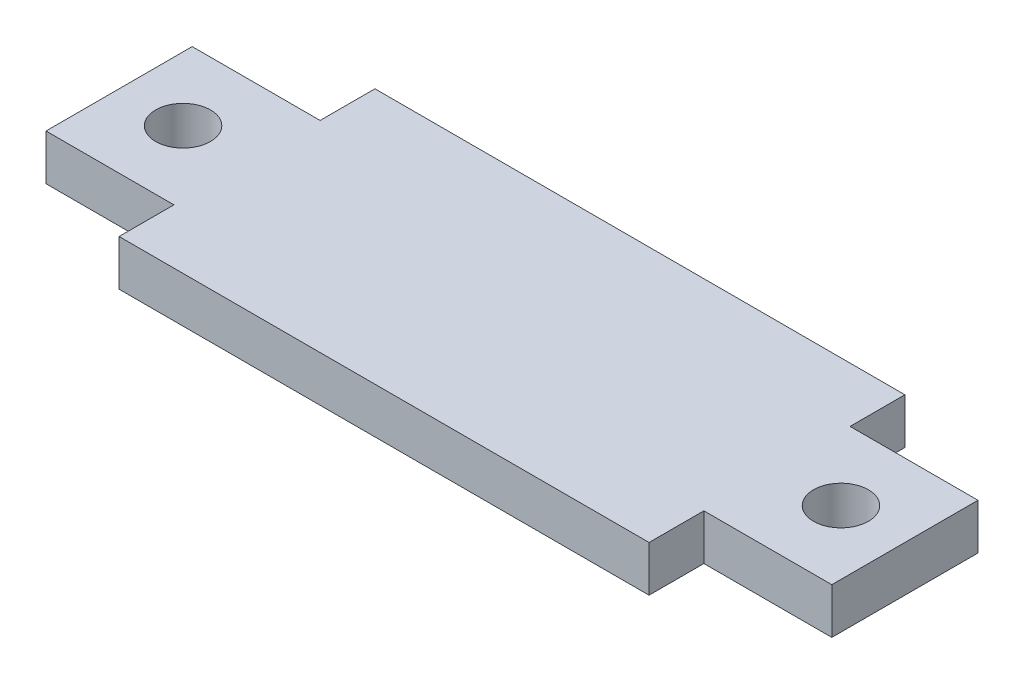
ISO-10303-21;
HEADER;
FILE_DESCRIPTION(('STEP AP214'),'2;1');
FILE_NAME('part.step','',(''),(''),'','','');
FILE_SCHEMA(('AUTOMOTIVE_DESIGN { 1 0 10303 214 1 1 1 1 }'));
ENDSEC;
DATA;
#1=APPLICATION_CONTEXT('core data for automotive mechanical design processes');
#2=APPLICATION_PROTOCOL_DEFINITION('international standard','automotive_design',2000,#1);
#3=PRODUCT_CONTEXT('',#1,'mechanical');
#4=PRODUCT('Part','Part','',(#3));
#5=PRODUCT_RELATED_PRODUCT_CATEGORY('part','',(#4));
#6=PRODUCT_DEFINITION_FORMATION('','',#4);
#7=PRODUCT_DEFINITION_CONTEXT('part definition',#1,'design');
#8=PRODUCT_DEFINITION('design','',#6,#7);
#9=PRODUCT_DEFINITION_SHAPE('','',#8);
#10=(LENGTH_UNIT() NAMED_UNIT(*) SI_UNIT(.MILLI.,.METRE.));
#11=(NAMED_UNIT(*) PLANE_ANGLE_UNIT() SI_UNIT($,.RADIAN.));
#12=(NAMED_UNIT(*) SI_UNIT($,.STERADIAN.) SOLID_ANGLE_UNIT());
#13=UNCERTAINTY_MEASURE_WITH_UNIT(LENGTH_MEASURE(1.E-05),#10,'distance_accuracy_value','');
#14=(GEOMETRIC_REPRESENTATION_CONTEXT(3) GLOBAL_UNCERTAINTY_ASSIGNED_CONTEXT((#13)) GLOBAL_UNIT_ASSIGNED_CONTEXT((#10,
#11,#12)) REPRESENTATION_CONTEXT('',''));
#15=CARTESIAN_POINT('',(0.,0.,0.));
#16=DIRECTION('',(0.,0.,1.));
#17=DIRECTION('',(1.,0.,0.));
#18=AXIS2_PLACEMENT_3D('',#15,#16,#17);
#19=CARTESIAN_POINT('',(14.5,2.5,0.));
#20=DIRECTION('',(1.,0.,0.));
#21=DIRECTION('',(0.,0.,-1.));
#22=AXIS2_PLACEMENT_3D('',#19,#20,#21);
#23=PLANE('',#22);
#24=DIRECTION('',(0.,0.,1.));
#25=VECTOR('',#24,1.);
#26=CARTESIAN_POINT('',(14.5,0.,0.));
#27=LINE('',#26,#25);
#28=CARTESIAN_POINT('',(14.5,0.,-7.));
#29=VERTEX_POINT('',#28);
#30=CARTESIAN_POINT('',(14.5,0.,-4.));
#31=VERTEX_POINT('',#30);
#32=EDGE_CURVE('E159',#29,#31,#27,.T.);
#33=ORIENTED_EDGE('',*,*,#32,.F.);
#34=DIRECTION('',(0.,-1.,0.));
#35=VECTOR('',#34,1.);
#36=CARTESIAN_POINT('',(14.5,2.5,-7.));
#37=LINE('',#36,#35);
#38=CARTESIAN_POINT('',(14.5,2.5,-7.));
#39=VERTEX_POINT('',#38);
#40=EDGE_CURVE('E11',#39,#29,#37,.T.);
#41=ORIENTED_EDGE('',*,*,#40,.F.);
#42=DIRECTION('',(0.,0.,1.));
#43=VECTOR('',#42,1.);
#44=CARTESIAN_POINT('',(14.5,2.5,0.));
#45=LINE('',#44,#43);
#46=CARTESIAN_POINT('',(14.5,2.5,-4.));
#47=VERTEX_POINT('',#46);
#48=EDGE_CURVE('E191',#39,#47,#45,.T.);
#49=ORIENTED_EDGE('',*,*,#48,.T.);
#50=DIRECTION('',(0.,-1.,0.));
#51=VECTOR('',#50,1.);
#52=CARTESIAN_POINT('',(14.5,2.5,-4.));
#53=LINE('',#52,#51);
#54=EDGE_CURVE('E52',#47,#31,#53,.T.);
#55=ORIENTED_EDGE('',*,*,#54,.T.);
#56=EDGE_LOOP('',(#33,#41,#49,#55));
#57=FACE_BOUND('',#56,.T.);
#58=ADVANCED_FACE('F35',(#57),#23,.T.);
#59=CARTESIAN_POINT('',(0.,2.5,-7.));
#60=DIRECTION('',(0.,0.,-1.));
#61=DIRECTION('',(-1.,0.,0.));
#62=AXIS2_PLACEMENT_3D('',#59,#60,#61);
#63=PLANE('',#62);
#64=DIRECTION('',(1.,0.,0.));
#65=VECTOR('',#64,1.);
#66=CARTESIAN_POINT('',(0.,0.,-7.));
#67=LINE('',#66,#65);
#68=CARTESIAN_POINT('',(-14.5,0.,-7.));
#69=VERTEX_POINT('',#68);
#70=EDGE_CURVE('E161',#69,#29,#67,.T.);
#71=ORIENTED_EDGE('',*,*,#70,.F.);
#72=DIRECTION('',(0.,-1.,0.));
#73=VECTOR('',#72,1.);
#74=CARTESIAN_POINT('',(-14.5,2.5,-7.));
#75=LINE('',#74,#73);
#76=CARTESIAN_POINT('',(-14.5,2.5,-7.));
#77=VERTEX_POINT('',#76);
#78=EDGE_CURVE('E44',#77,#69,#75,.T.);
#79=ORIENTED_EDGE('',*,*,#78,.F.);
#80=DIRECTION('',(1.,0.,0.));
#81=VECTOR('',#80,1.);
#82=CARTESIAN_POINT('',(0.,2.5,-7.));
#83=LINE('',#82,#81);
#84=EDGE_CURVE('E224',#77,#39,#83,.T.);
#85=ORIENTED_EDGE('',*,*,#84,.T.);
#86=ORIENTED_EDGE('',*,*,#40,.T.);
#87=EDGE_LOOP('',(#71,#79,#85,#86));
#88=FACE_BOUND('',#87,.T.);
#89=ADVANCED_FACE('F37',(#88),#63,.T.);
#90=CARTESIAN_POINT('',(-14.5,2.5,0.));
#91=DIRECTION('',(1.,0.,0.));
#92=DIRECTION('',(0.,0.,-1.));
#93=AXIS2_PLACEMENT_3D('',#90,#91,#92);
#94=PLANE('',#93);
#95=DIRECTION('',(0.,0.,1.));
#96=VECTOR('',#95,1.);
#97=CARTESIAN_POINT('',(-14.5,0.,0.));
#98=LINE('',#97,#96);
#99=CARTESIAN_POINT('',(-14.5,0.,-4.));
#100=VERTEX_POINT('',#99);
#101=EDGE_CURVE('E165',#69,#100,#98,.T.);
#102=ORIENTED_EDGE('',*,*,#101,.T.);
#103=DIRECTION('',(0.,-1.,0.));
#104=VECTOR('',#103,1.);
#105=CARTESIAN_POINT('',(-14.5,2.5,-4.));
#106=LINE('',#105,#104);
#107=CARTESIAN_POINT('',(-14.5,2.5,-4.));
#108=VERTEX_POINT('',#107);
#109=EDGE_CURVE('E207',#108,#100,#106,.T.);
#110=ORIENTED_EDGE('',*,*,#109,.F.);
#111=DIRECTION('',(0.,0.,1.));
#112=VECTOR('',#111,1.);
#113=CARTESIAN_POINT('',(-14.5,2.5,0.));
#114=LINE('',#113,#112);
#115=EDGE_CURVE('E214',#77,#108,#114,.T.);
#116=ORIENTED_EDGE('',*,*,#115,.F.);
#117=ORIENTED_EDGE('',*,*,#78,.T.);
#118=EDGE_LOOP('',(#102,#110,#116,#117));
#119=FACE_BOUND('',#118,.T.);
#120=ADVANCED_FACE('F212',(#119),#94,.F.);
#121=CARTESIAN_POINT('',(0.,2.5,-4.));
#122=DIRECTION('',(0.,0.,1.));
#123=DIRECTION('',(1.,0.,0.));
#124=AXIS2_PLACEMENT_3D('',#121,#122,#123);
#125=PLANE('',#124);
#126=DIRECTION('',(-1.,0.,0.));
#127=VECTOR('',#126,1.);
#128=CARTESIAN_POINT('',(0.,0.,-4.));
#129=LINE('',#128,#127);
#130=CARTESIAN_POINT('',(-21.5,0.,-4.));
#131=VERTEX_POINT('',#130);
#132=EDGE_CURVE('E167',#100,#131,#129,.T.);
#133=ORIENTED_EDGE('',*,*,#132,.T.);
#134=DIRECTION('',(0.,-1.,0.));
#135=VECTOR('',#134,1.);
#136=CARTESIAN_POINT('',(-21.5,2.5,-4.));
#137=LINE('',#136,#135);
#138=CARTESIAN_POINT('',(-21.5,2.5,-4.));
#139=VERTEX_POINT('',#138);
#140=EDGE_CURVE('E204',#139,#131,#137,.T.);
#141=ORIENTED_EDGE('',*,*,#140,.F.);
#142=DIRECTION('',(-1.,0.,0.));
#143=VECTOR('',#142,1.);
#144=CARTESIAN_POINT('',(0.,2.5,-4.));
#145=LINE('',#144,#143);
#146=EDGE_CURVE('E282',#108,#139,#145,.T.);
#147=ORIENTED_EDGE('',*,*,#146,.F.);
#148=ORIENTED_EDGE('',*,*,#109,.T.);
#149=EDGE_LOOP('',(#133,#141,#147,#148));
#150=FACE_BOUND('',#149,.T.);
#151=ADVANCED_FACE('F281',(#150),#125,.F.);
#152=CARTESIAN_POINT('',(-21.5,2.5,0.));
#153=DIRECTION('',(1.,0.,0.));
#154=DIRECTION('',(0.,0.,-1.));
#155=AXIS2_PLACEMENT_3D('',#152,#153,#154);
#156=PLANE('',#155);
#157=DIRECTION('',(0.,0.,1.));
#158=VECTOR('',#157,1.);
#159=CARTESIAN_POINT('',(-21.5,0.,0.));
#160=LINE('',#159,#158);
#161=CARTESIAN_POINT('',(-21.5,0.,4.));
#162=VERTEX_POINT('',#161);
#163=EDGE_CURVE('E170',#131,#162,#160,.T.);
#164=ORIENTED_EDGE('',*,*,#163,.T.);
#165=DIRECTION('',(0.,-1.,0.));
#166=VECTOR('',#165,1.);
#167=CARTESIAN_POINT('',(-21.5,2.5,4.));
#168=LINE('',#167,#166);
#169=CARTESIAN_POINT('',(-21.5,2.5,4.));
#170=VERTEX_POINT('',#169);
#171=EDGE_CURVE('E202',#170,#162,#168,.T.);
#172=ORIENTED_EDGE('',*,*,#171,.F.);
#173=DIRECTION('',(0.,0.,1.));
#174=VECTOR('',#173,1.);
#175=CARTESIAN_POINT('',(-21.5,2.5,0.));
#176=LINE('',#175,#174);
#177=EDGE_CURVE('E278',#139,#170,#176,.T.);
#178=ORIENTED_EDGE('',*,*,#177,.F.);
#179=ORIENTED_EDGE('',*,*,#140,.T.);
#180=EDGE_LOOP('',(#164,#172,#178,#179));
#181=FACE_BOUND('',#180,.T.);
#182=ADVANCED_FACE('F275',(#181),#156,.F.);
#183=CARTESIAN_POINT('',(0.,2.5,4.));
#184=DIRECTION('',(0.,0.,1.));
#185=DIRECTION('',(1.,0.,0.));
#186=AXIS2_PLACEMENT_3D('',#183,#184,#185);
#187=PLANE('',#186);
#188=DIRECTION('',(-1.,0.,0.));
#189=VECTOR('',#188,1.);
#190=CARTESIAN_POINT('',(0.,0.,4.));
#191=LINE('',#190,#189);
#192=CARTESIAN_POINT('',(-14.5,0.,4.));
#193=VERTEX_POINT('',#192);
#194=EDGE_CURVE('E173',#193,#162,#191,.T.);
#195=ORIENTED_EDGE('',*,*,#194,.F.);
#196=DIRECTION('',(0.,-1.,0.));
#197=VECTOR('',#196,1.);
#198=CARTESIAN_POINT('',(-14.5,2.5,4.));
#199=LINE('',#198,#197);
#200=CARTESIAN_POINT('',(-14.5,2.5,4.));
#201=VERTEX_POINT('',#200);
#202=EDGE_CURVE('E200',#201,#193,#199,.T.);
#203=ORIENTED_EDGE('',*,*,#202,.F.);
#204=DIRECTION('',(-1.,0.,0.));
#205=VECTOR('',#204,1.);
#206=CARTESIAN_POINT('',(0.,2.5,4.));
#207=LINE('',#206,#205);
#208=EDGE_CURVE('E272',#201,#170,#207,.T.);
#209=ORIENTED_EDGE('',*,*,#208,.T.);
#210=ORIENTED_EDGE('',*,*,#171,.T.);
#211=EDGE_LOOP('',(#195,#203,#209,#210));
#212=FACE_BOUND('',#211,.T.);
#213=ADVANCED_FACE('F271',(#212),#187,.T.);
#214=CARTESIAN_POINT('',(-14.5,0.,7.));
#215=VERTEX_POINT('',#214);
#216=EDGE_CURVE('E168',#193,#215,#98,.T.);
#217=ORIENTED_EDGE('',*,*,#216,.T.);
#218=DIRECTION('',(0.,-1.,0.));
#219=VECTOR('',#218,1.);
#220=CARTESIAN_POINT('',(-14.5,2.5,7.));
#221=LINE('',#220,#219);
#222=CARTESIAN_POINT('',(-14.5,2.5,7.));
#223=VERTEX_POINT('',#222);
#224=EDGE_CURVE('E197',#223,#215,#221,.T.);
#225=ORIENTED_EDGE('',*,*,#224,.F.);
#226=EDGE_CURVE('E267',#201,#223,#114,.T.);
#227=ORIENTED_EDGE('',*,*,#226,.F.);
#228=ORIENTED_EDGE('',*,*,#202,.T.);
#229=EDGE_LOOP('',(#217,#225,#227,#228));
#230=FACE_BOUND('',#229,.T.);
#231=ADVANCED_FACE('F254',(#230),#94,.F.);
#232=CARTESIAN_POINT('',(0.,2.5,7.));
#233=DIRECTION('',(0.,0.,-1.));
#234=DIRECTION('',(-1.,0.,0.));
#235=AXIS2_PLACEMENT_3D('',#232,#233,#234);
#236=PLANE('',#235);
#237=DIRECTION('',(1.,0.,0.));
#238=VECTOR('',#237,1.);
#239=CARTESIAN_POINT('',(0.,0.,7.));
#240=LINE('',#239,#238);
#241=CARTESIAN_POINT('',(14.5,0.,7.));
#242=VERTEX_POINT('',#241);
#243=EDGE_CURVE('E176',#215,#242,#240,.T.);
#244=ORIENTED_EDGE('',*,*,#243,.T.);
#245=DIRECTION('',(0.,-1.,0.));
#246=VECTOR('',#245,1.);
#247=CARTESIAN_POINT('',(14.5,2.5,7.));
#248=LINE('',#247,#246);
#249=CARTESIAN_POINT('',(14.5,2.5,7.));
#250=VERTEX_POINT('',#249);
#251=EDGE_CURVE('E195',#250,#242,#248,.T.);
#252=ORIENTED_EDGE('',*,*,#251,.F.);
#253=DIRECTION('',(1.,0.,0.));
#254=VECTOR('',#253,1.);
#255=CARTESIAN_POINT('',(0.,2.5,7.));
#256=LINE('',#255,#254);
#257=EDGE_CURVE('E264',#223,#250,#256,.T.);
#258=ORIENTED_EDGE('',*,*,#257,.F.);
#259=ORIENTED_EDGE('',*,*,#224,.T.);
#260=EDGE_LOOP('',(#244,#252,#258,#259));
#261=FACE_BOUND('',#260,.T.);
#262=ADVANCED_FACE('F248',(#261),#236,.F.);
#263=CARTESIAN_POINT('',(14.5,0.,4.));
#264=VERTEX_POINT('',#263);
#265=EDGE_CURVE('E162',#264,#242,#27,.T.);
#266=ORIENTED_EDGE('',*,*,#265,.F.);
#267=DIRECTION('',(0.,-1.,0.));
#268=VECTOR('',#267,1.);
#269=CARTESIAN_POINT('',(14.5,2.5,4.));
#270=LINE('',#269,#268);
#271=CARTESIAN_POINT('',(14.5,2.5,4.));
#272=VERTEX_POINT('',#271);
#273=EDGE_CURVE('E145',#272,#264,#270,.T.);
#274=ORIENTED_EDGE('',*,*,#273,.F.);
#275=EDGE_CURVE('E135',#272,#250,#45,.T.);
#276=ORIENTED_EDGE('',*,*,#275,.T.);
#277=ORIENTED_EDGE('',*,*,#251,.T.);
#278=EDGE_LOOP('',(#266,#274,#276,#277));
#279=FACE_BOUND('',#278,.T.);
#280=ADVANCED_FACE('F241',(#279),#23,.T.);
#281=CARTESIAN_POINT('',(0.,2.5,4.));
#282=DIRECTION('',(0.,0.,-1.));
#283=DIRECTION('',(-1.,0.,0.));
#284=AXIS2_PLACEMENT_3D('',#281,#282,#283);
#285=PLANE('',#284);
#286=DIRECTION('',(1.,0.,0.));
#287=VECTOR('',#286,1.);
#288=CARTESIAN_POINT('',(0.,0.,4.));
#289=LINE('',#288,#287);
#290=CARTESIAN_POINT('',(21.5,0.,4.));
#291=VERTEX_POINT('',#290);
#292=EDGE_CURVE('E142',#264,#291,#289,.T.);
#293=ORIENTED_EDGE('',*,*,#292,.T.);
#294=DIRECTION('',(0.,-1.,0.));
#295=VECTOR('',#294,1.);
#296=CARTESIAN_POINT('',(21.5,2.5,4.));
#297=LINE('',#296,#295);
#298=CARTESIAN_POINT('',(21.5,2.5,4.));
#299=VERTEX_POINT('',#298);
#300=EDGE_CURVE('E139',#299,#291,#297,.T.);
#301=ORIENTED_EDGE('',*,*,#300,.F.);
#302=DIRECTION('',(1.,0.,0.));
#303=VECTOR('',#302,1.);
#304=CARTESIAN_POINT('',(0.,2.5,4.));
#305=LINE('',#304,#303);
#306=EDGE_CURVE('E127',#272,#299,#305,.T.);
#307=ORIENTED_EDGE('',*,*,#306,.F.);
#308=ORIENTED_EDGE('',*,*,#273,.T.);
#309=EDGE_LOOP('',(#293,#301,#307,#308));
#310=FACE_BOUND('',#309,.T.);
#311=ADVANCED_FACE('F140',(#310),#285,.F.);
#312=CARTESIAN_POINT('',(21.5,2.5,0.));
#313=DIRECTION('',(1.,0.,0.));
#314=DIRECTION('',(0.,0.,-1.));
#315=AXIS2_PLACEMENT_3D('',#312,#313,#314);
#316=PLANE('',#315);
#317=DIRECTION('',(0.,0.,1.));
#318=VECTOR('',#317,1.);
#319=CARTESIAN_POINT('',(21.5,0.,0.));
#320=LINE('',#319,#318);
#321=CARTESIAN_POINT('',(21.5,0.,-4.));
#322=VERTEX_POINT('',#321);
#323=EDGE_CURVE('E180',#322,#291,#320,.T.);
#324=ORIENTED_EDGE('',*,*,#323,.F.);
#325=DIRECTION('',(0.,-1.,0.));
#326=VECTOR('',#325,1.);
#327=CARTESIAN_POINT('',(21.5,2.5,-4.));
#328=LINE('',#327,#326);
#329=CARTESIAN_POINT('',(21.5,2.5,-4.));
#330=VERTEX_POINT('',#329);
#331=EDGE_CURVE('E89',#330,#322,#328,.T.);
#332=ORIENTED_EDGE('',*,*,#331,.F.);
#333=DIRECTION('',(0.,0.,1.));
#334=VECTOR('',#333,1.);
#335=CARTESIAN_POINT('',(21.5,2.5,0.));
#336=LINE('',#335,#334);
#337=EDGE_CURVE('E133',#330,#299,#336,.T.);
#338=ORIENTED_EDGE('',*,*,#337,.T.);
#339=ORIENTED_EDGE('',*,*,#300,.T.);
#340=EDGE_LOOP('',(#324,#332,#338,#339));
#341=FACE_BOUND('',#340,.T.);
#342=ADVANCED_FACE('F147',(#341),#316,.T.);
#343=CARTESIAN_POINT('',(-18.,2.5,0.));
#344=DIRECTION('',(0.,-1.,0.));
#345=DIRECTION('',(0.,0.,-1.));
#346=AXIS2_PLACEMENT_3D('',#343,#344,#345);
#347=CYLINDRICAL_SURFACE('',#346,1.5);
#348=CARTESIAN_POINT('',(-18.,2.5,0.));
#349=DIRECTION('',(0.,1.,0.));
#350=DIRECTION('',(0.,0.,1.));
#351=AXIS2_PLACEMENT_3D('',#348,#349,#350);
#352=CIRCLE('',#351,1.5);
#353=CARTESIAN_POINT('',(-18.,2.5,1.5));
#354=VERTEX_POINT('',#353);
#355=EDGE_CURVE('E150',#354,#354,#352,.T.);
#356=ORIENTED_EDGE('',*,*,#355,.T.);
#357=EDGE_LOOP('',(#356));
#358=FACE_BOUND('',#357,.T.);
#359=CARTESIAN_POINT('',(-18.,0.,0.));
#360=DIRECTION('',(0.,1.,0.));
#361=DIRECTION('',(0.,0.,1.));
#362=AXIS2_PLACEMENT_3D('',#359,#360,#361);
#363=CIRCLE('',#362,1.5);
#364=CARTESIAN_POINT('',(-18.,0.,1.5));
#365=VERTEX_POINT('',#364);
#366=EDGE_CURVE('E185',#365,#365,#363,.T.);
#367=ORIENTED_EDGE('',*,*,#366,.F.);
#368=EDGE_LOOP('',(#367));
#369=FACE_BOUND('',#368,.T.);
#370=ADVANCED_FACE('F228',(#358,#369),#347,.F.);
#371=CARTESIAN_POINT('',(0.,2.5,-4.));
#372=DIRECTION('',(0.,0.,-1.));
#373=DIRECTION('',(-1.,0.,0.));
#374=AXIS2_PLACEMENT_3D('',#371,#372,#373);
#375=PLANE('',#374);
#376=DIRECTION('',(1.,0.,0.));
#377=VECTOR('',#376,1.);
#378=CARTESIAN_POINT('',(0.,0.,-4.));
#379=LINE('',#378,#377);
#380=EDGE_CURVE('E182',#31,#322,#379,.T.);
#381=ORIENTED_EDGE('',*,*,#380,.F.);
#382=ORIENTED_EDGE('',*,*,#54,.F.);
#383=DIRECTION('',(1.,0.,0.));
#384=VECTOR('',#383,1.);
#385=CARTESIAN_POINT('',(0.,2.5,-4.));
#386=LINE('',#385,#384);
#387=EDGE_CURVE('E148',#47,#330,#386,.T.);
#388=ORIENTED_EDGE('',*,*,#387,.T.);
#389=ORIENTED_EDGE('',*,*,#331,.T.);
#390=EDGE_LOOP('',(#381,#382,#388,#389));
#391=FACE_BOUND('',#390,.T.);
#392=ADVANCED_FACE('F225',(#391),#375,.T.);
#393=CARTESIAN_POINT('',(18.,2.5,0.));
#394=DIRECTION('',(0.,-1.,0.));
#395=DIRECTION('',(0.,0.,-1.));
#396=AXIS2_PLACEMENT_3D('',#393,#394,#395);
#397=CYLINDRICAL_SURFACE('',#396,1.5);
#398=CARTESIAN_POINT('',(18.,2.5,0.));
#399=DIRECTION('',(0.,1.,0.));
#400=DIRECTION('',(0.,0.,1.));
#401=AXIS2_PLACEMENT_3D('',#398,#399,#400);
#402=CIRCLE('',#401,1.5);
#403=CARTESIAN_POINT('',(18.,2.5,1.5));
#404=VERTEX_POINT('',#403);
#405=EDGE_CURVE('E156',#404,#404,#402,.T.);
#406=ORIENTED_EDGE('',*,*,#405,.T.);
#407=EDGE_LOOP('',(#406));
#408=FACE_BOUND('',#407,.T.);
#409=CARTESIAN_POINT('',(18.,0.,0.));
#410=DIRECTION('',(0.,1.,0.));
#411=DIRECTION('',(0.,0.,1.));
#412=AXIS2_PLACEMENT_3D('',#409,#410,#411);
#413=CIRCLE('',#412,1.5);
#414=CARTESIAN_POINT('',(18.,0.,1.5));
#415=VERTEX_POINT('',#414);
#416=EDGE_CURVE('E188',#415,#415,#413,.T.);
#417=ORIENTED_EDGE('',*,*,#416,.F.);
#418=EDGE_LOOP('',(#417));
#419=FACE_BOUND('',#418,.T.);
#420=ADVANCED_FACE('F227',(#408,#419),#397,.F.);
#421=CARTESIAN_POINT('',(0.,2.5,0.));
#422=DIRECTION('',(0.,1.,0.));
#423=DIRECTION('',(0.,0.,1.));
#424=AXIS2_PLACEMENT_3D('',#421,#422,#423);
#425=PLANE('',#424);
#426=ORIENTED_EDGE('',*,*,#48,.F.);
#427=ORIENTED_EDGE('',*,*,#84,.F.);
#428=ORIENTED_EDGE('',*,*,#115,.T.);
#429=ORIENTED_EDGE('',*,*,#146,.T.);
#430=ORIENTED_EDGE('',*,*,#177,.T.);
#431=ORIENTED_EDGE('',*,*,#208,.F.);
#432=ORIENTED_EDGE('',*,*,#226,.T.);
#433=ORIENTED_EDGE('',*,*,#257,.T.);
#434=ORIENTED_EDGE('',*,*,#275,.F.);
#435=ORIENTED_EDGE('',*,*,#306,.T.);
#436=ORIENTED_EDGE('',*,*,#337,.F.);
#437=ORIENTED_EDGE('',*,*,#387,.F.);
#438=EDGE_LOOP('',(#426,#427,#428,#429,#430,#431,#432,#433,#434,#435,#436,#437));
#439=FACE_BOUND('',#438,.T.);
#440=ORIENTED_EDGE('',*,*,#355,.F.);
#441=EDGE_LOOP('',(#440));
#442=FACE_BOUND('',#441,.T.);
#443=ORIENTED_EDGE('',*,*,#405,.F.);
#444=EDGE_LOOP('',(#443));
#445=FACE_BOUND('',#444,.T.);
#446=ADVANCED_FACE('F129',(#439,#442,#445),#425,.T.);
#447=CARTESIAN_POINT('',(0.,0.,0.));
#448=DIRECTION('',(0.,1.,0.));
#449=DIRECTION('',(0.,0.,1.));
#450=AXIS2_PLACEMENT_3D('',#447,#448,#449);
#451=PLANE('',#450);
#452=ORIENTED_EDGE('',*,*,#32,.T.);
#453=ORIENTED_EDGE('',*,*,#380,.T.);
#454=ORIENTED_EDGE('',*,*,#323,.T.);
#455=ORIENTED_EDGE('',*,*,#292,.F.);
#456=ORIENTED_EDGE('',*,*,#265,.T.);
#457=ORIENTED_EDGE('',*,*,#243,.F.);
#458=ORIENTED_EDGE('',*,*,#216,.F.);
#459=ORIENTED_EDGE('',*,*,#194,.T.);
#460=ORIENTED_EDGE('',*,*,#163,.F.);
#461=ORIENTED_EDGE('',*,*,#132,.F.);
#462=ORIENTED_EDGE('',*,*,#101,.F.);
#463=ORIENTED_EDGE('',*,*,#70,.T.);
#464=EDGE_LOOP('',(#452,#453,#454,#455,#456,#457,#458,#459,#460,#461,#462,#463));
#465=FACE_BOUND('',#464,.T.);
#466=ORIENTED_EDGE('',*,*,#366,.T.);
#467=EDGE_LOOP('',(#466));
#468=FACE_BOUND('',#467,.T.);
#469=ORIENTED_EDGE('',*,*,#416,.T.);
#470=EDGE_LOOP('',(#469));
#471=FACE_BOUND('',#470,.T.);
#472=ADVANCED_FACE('F221',(#465,#468,#471),#451,.F.);
#473=CLOSED_SHELL('',(#58,#89,#120,#151,#182,#213,#231,#262,#280,#311,#342,#370,#392,#420,#446,#472));
#474=MANIFOLD_SOLID_BREP('B2',#473);
#475=ADVANCED_BREP_SHAPE_REPRESENTATION('',(#18,#474),#14);
#476=SHAPE_DEFINITION_REPRESENTATION(#9,#475);
ENDSEC;
END-ISO-10303-21;
